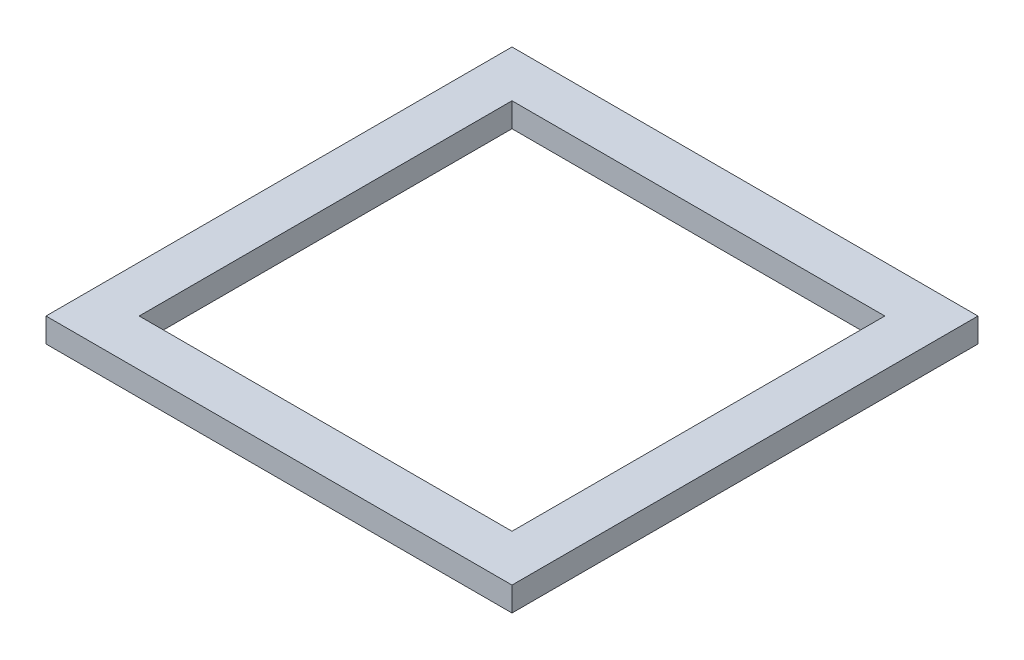
ISO-10303-21;
HEADER;
FILE_DESCRIPTION(('STEP AP214'),'2;1');
FILE_NAME('part.step','',(''),(''),'','','');
FILE_SCHEMA(('AUTOMOTIVE_DESIGN { 1 0 10303 214 1 1 1 1 }'));
ENDSEC;
DATA;
#1=APPLICATION_CONTEXT('core data for automotive mechanical design processes');
#2=APPLICATION_PROTOCOL_DEFINITION('international standard','automotive_design',2000,#1);
#3=PRODUCT_CONTEXT('',#1,'mechanical');
#4=PRODUCT('Part','Part','',(#3));
#5=PRODUCT_RELATED_PRODUCT_CATEGORY('part','',(#4));
#6=PRODUCT_DEFINITION_FORMATION('','',#4);
#7=PRODUCT_DEFINITION_CONTEXT('part definition',#1,'design');
#8=PRODUCT_DEFINITION('design','',#6,#7);
#9=PRODUCT_DEFINITION_SHAPE('','',#8);
#10=(LENGTH_UNIT() NAMED_UNIT(*) SI_UNIT(.MILLI.,.METRE.));
#11=(NAMED_UNIT(*) PLANE_ANGLE_UNIT() SI_UNIT($,.RADIAN.));
#12=(NAMED_UNIT(*) SI_UNIT($,.STERADIAN.) SOLID_ANGLE_UNIT());
#13=UNCERTAINTY_MEASURE_WITH_UNIT(LENGTH_MEASURE(1.E-05),#10,'distance_accuracy_value','');
#14=(GEOMETRIC_REPRESENTATION_CONTEXT(3) GLOBAL_UNCERTAINTY_ASSIGNED_CONTEXT((#13)) GLOBAL_UNIT_ASSIGNED_CONTEXT((#10,
#11,#12)) REPRESENTATION_CONTEXT('',''));
#15=CARTESIAN_POINT('',(0.,0.,0.));
#16=DIRECTION('',(0.,0.,1.));
#17=DIRECTION('',(1.,0.,0.));
#18=AXIS2_PLACEMENT_3D('',#15,#16,#17);
#19=CARTESIAN_POINT('',(0.,6.477,31.75));
#20=DIRECTION('',(0.,0.,-1.));
#21=DIRECTION('',(-1.,0.,0.));
#22=AXIS2_PLACEMENT_3D('',#19,#20,#21);
#23=PLANE('',#22);
#24=DIRECTION('',(1.,0.,0.));
#25=VECTOR('',#24,1.);
#26=CARTESIAN_POINT('',(0.,3.175,31.75));
#27=LINE('',#26,#25);
#28=CARTESIAN_POINT('',(-31.75,3.175,31.75));
#29=VERTEX_POINT('',#28);
#30=CARTESIAN_POINT('',(31.75,3.175,31.75));
#31=VERTEX_POINT('',#30);
#32=EDGE_CURVE('E134',#29,#31,#27,.T.);
#33=ORIENTED_EDGE('',*,*,#32,.T.);
#34=DIRECTION('',(0.,-1.,0.));
#35=VECTOR('',#34,1.);
#36=CARTESIAN_POINT('',(31.75,6.477,31.75));
#37=LINE('',#36,#35);
#38=CARTESIAN_POINT('',(31.75,6.477,31.75));
#39=VERTEX_POINT('',#38);
#40=EDGE_CURVE('E12',#39,#31,#37,.T.);
#41=ORIENTED_EDGE('',*,*,#40,.F.);
#42=DIRECTION('',(1.,0.,0.));
#43=VECTOR('',#42,1.);
#44=CARTESIAN_POINT('',(0.,6.477,31.75));
#45=LINE('',#44,#43);
#46=CARTESIAN_POINT('',(-31.75,6.477,31.75));
#47=VERTEX_POINT('',#46);
#48=EDGE_CURVE('E139',#47,#39,#45,.T.);
#49=ORIENTED_EDGE('',*,*,#48,.F.);
#50=DIRECTION('',(0.,-1.,0.));
#51=VECTOR('',#50,1.);
#52=CARTESIAN_POINT('',(-31.75,6.477,31.75));
#53=LINE('',#52,#51);
#54=EDGE_CURVE('E152',#47,#29,#53,.T.);
#55=ORIENTED_EDGE('',*,*,#54,.T.);
#56=EDGE_LOOP('',(#33,#41,#49,#55));
#57=FACE_BOUND('',#56,.T.);
#58=ADVANCED_FACE('F64',(#57),#23,.F.);
#59=CARTESIAN_POINT('',(31.75,6.477,0.));
#60=DIRECTION('',(1.,0.,0.));
#61=DIRECTION('',(0.,0.,-1.));
#62=AXIS2_PLACEMENT_3D('',#59,#60,#61);
#63=PLANE('',#62);
#64=DIRECTION('',(0.,0.,1.));
#65=VECTOR('',#64,1.);
#66=CARTESIAN_POINT('',(31.75,3.175,0.));
#67=LINE('',#66,#65);
#68=CARTESIAN_POINT('',(31.75,3.175,-31.75));
#69=VERTEX_POINT('',#68);
#70=EDGE_CURVE('E147',#69,#31,#67,.T.);
#71=ORIENTED_EDGE('',*,*,#70,.F.);
#72=DIRECTION('',(0.,-1.,0.));
#73=VECTOR('',#72,1.);
#74=CARTESIAN_POINT('',(31.75,6.477,-31.75));
#75=LINE('',#74,#73);
#76=CARTESIAN_POINT('',(31.75,6.477,-31.75));
#77=VERTEX_POINT('',#76);
#78=EDGE_CURVE('E71',#77,#69,#75,.T.);
#79=ORIENTED_EDGE('',*,*,#78,.F.);
#80=DIRECTION('',(0.,0.,1.));
#81=VECTOR('',#80,1.);
#82=CARTESIAN_POINT('',(31.75,6.477,0.));
#83=LINE('',#82,#81);
#84=EDGE_CURVE('E162',#77,#39,#83,.T.);
#85=ORIENTED_EDGE('',*,*,#84,.T.);
#86=ORIENTED_EDGE('',*,*,#40,.T.);
#87=EDGE_LOOP('',(#71,#79,#85,#86));
#88=FACE_BOUND('',#87,.T.);
#89=ADVANCED_FACE('F217',(#88),#63,.T.);
#90=CARTESIAN_POINT('',(0.,6.477,-31.75));
#91=DIRECTION('',(0.,0.,-1.));
#92=DIRECTION('',(-1.,0.,0.));
#93=AXIS2_PLACEMENT_3D('',#90,#91,#92);
#94=PLANE('',#93);
#95=DIRECTION('',(1.,0.,0.));
#96=VECTOR('',#95,1.);
#97=CARTESIAN_POINT('',(0.,3.175,-31.75));
#98=LINE('',#97,#96);
#99=CARTESIAN_POINT('',(-31.75,3.175,-31.75));
#100=VERTEX_POINT('',#99);
#101=EDGE_CURVE('E131',#100,#69,#98,.T.);
#102=ORIENTED_EDGE('',*,*,#101,.F.);
#103=DIRECTION('',(0.,-1.,0.));
#104=VECTOR('',#103,1.);
#105=CARTESIAN_POINT('',(-31.75,6.477,-31.75));
#106=LINE('',#105,#104);
#107=CARTESIAN_POINT('',(-31.75,6.477,-31.75));
#108=VERTEX_POINT('',#107);
#109=EDGE_CURVE('E144',#108,#100,#106,.T.);
#110=ORIENTED_EDGE('',*,*,#109,.F.);
#111=DIRECTION('',(1.,0.,0.));
#112=VECTOR('',#111,1.);
#113=CARTESIAN_POINT('',(0.,6.477,-31.75));
#114=LINE('',#113,#112);
#115=EDGE_CURVE('E160',#108,#77,#114,.T.);
#116=ORIENTED_EDGE('',*,*,#115,.T.);
#117=ORIENTED_EDGE('',*,*,#78,.T.);
#118=EDGE_LOOP('',(#102,#110,#116,#117));
#119=FACE_BOUND('',#118,.T.);
#120=ADVANCED_FACE('F142',(#119),#94,.T.);
#121=CARTESIAN_POINT('',(-31.75,6.477,0.));
#122=DIRECTION('',(1.,0.,0.));
#123=DIRECTION('',(0.,0.,-1.));
#124=AXIS2_PLACEMENT_3D('',#121,#122,#123);
#125=PLANE('',#124);
#126=DIRECTION('',(0.,0.,1.));
#127=VECTOR('',#126,1.);
#128=CARTESIAN_POINT('',(-31.75,3.175,0.));
#129=LINE('',#128,#127);
#130=EDGE_CURVE('E128',#100,#29,#129,.T.);
#131=ORIENTED_EDGE('',*,*,#130,.T.);
#132=ORIENTED_EDGE('',*,*,#54,.F.);
#133=DIRECTION('',(0.,0.,1.));
#134=VECTOR('',#133,1.);
#135=CARTESIAN_POINT('',(-31.75,6.477,0.));
#136=LINE('',#135,#134);
#137=EDGE_CURVE('E150',#108,#47,#136,.T.);
#138=ORIENTED_EDGE('',*,*,#137,.F.);
#139=ORIENTED_EDGE('',*,*,#109,.T.);
#140=EDGE_LOOP('',(#131,#132,#138,#139));
#141=FACE_BOUND('',#140,.T.);
#142=ADVANCED_FACE('F149',(#141),#125,.F.);
#143=CARTESIAN_POINT('',(0.,6.477,0.));
#144=DIRECTION('',(0.,-1.,0.));
#145=DIRECTION('',(0.,0.,-1.));
#146=AXIS2_PLACEMENT_3D('',#143,#144,#145);
#147=PLANE('',#146);
#148=DIRECTION('',(0.,0.,1.));
#149=VECTOR('',#148,1.);
#150=CARTESIAN_POINT('',(25.4,6.477,0.));
#151=LINE('',#150,#149);
#152=CARTESIAN_POINT('',(25.4,6.477,-25.4));
#153=VERTEX_POINT('',#152);
#154=CARTESIAN_POINT('',(25.4,6.477,25.4));
#155=VERTEX_POINT('',#154);
#156=EDGE_CURVE('E169',#153,#155,#151,.T.);
#157=ORIENTED_EDGE('',*,*,#156,.T.);
#158=DIRECTION('',(-1.,0.,0.));
#159=VECTOR('',#158,1.);
#160=CARTESIAN_POINT('',(0.,6.477,25.4));
#161=LINE('',#160,#159);
#162=CARTESIAN_POINT('',(-25.4,6.477,25.4));
#163=VERTEX_POINT('',#162);
#164=EDGE_CURVE('E176',#155,#163,#161,.T.);
#165=ORIENTED_EDGE('',*,*,#164,.T.);
#166=DIRECTION('',(0.,0.,1.));
#167=VECTOR('',#166,1.);
#168=CARTESIAN_POINT('',(-25.4,6.477,0.));
#169=LINE('',#168,#167);
#170=CARTESIAN_POINT('',(-25.4,6.477,-25.4));
#171=VERTEX_POINT('',#170);
#172=EDGE_CURVE('E188',#171,#163,#169,.T.);
#173=ORIENTED_EDGE('',*,*,#172,.F.);
#174=DIRECTION('',(-1.,0.,0.));
#175=VECTOR('',#174,1.);
#176=CARTESIAN_POINT('',(0.,6.477,-25.4));
#177=LINE('',#176,#175);
#178=EDGE_CURVE('E186',#153,#171,#177,.T.);
#179=ORIENTED_EDGE('',*,*,#178,.F.);
#180=EDGE_LOOP('',(#157,#165,#173,#179));
#181=FACE_BOUND('',#180,.T.);
#182=ORIENTED_EDGE('',*,*,#48,.T.);
#183=ORIENTED_EDGE('',*,*,#84,.F.);
#184=ORIENTED_EDGE('',*,*,#115,.F.);
#185=ORIENTED_EDGE('',*,*,#137,.T.);
#186=EDGE_LOOP('',(#182,#183,#184,#185));
#187=FACE_BOUND('',#186,.T.);
#188=ADVANCED_FACE('F194',(#181,#187),#147,.F.);
#189=CARTESIAN_POINT('',(0.,6.477,25.4));
#190=DIRECTION('',(0.,0.,1.));
#191=DIRECTION('',(1.,0.,0.));
#192=AXIS2_PLACEMENT_3D('',#189,#190,#191);
#193=PLANE('',#192);
#194=DIRECTION('',(-1.,0.,0.));
#195=VECTOR('',#194,1.);
#196=CARTESIAN_POINT('',(0.,3.175,25.4));
#197=LINE('',#196,#195);
#198=CARTESIAN_POINT('',(25.4,3.175,25.4));
#199=VERTEX_POINT('',#198);
#200=CARTESIAN_POINT('',(-25.4,3.175,25.4));
#201=VERTEX_POINT('',#200);
#202=EDGE_CURVE('E181',#199,#201,#197,.T.);
#203=ORIENTED_EDGE('',*,*,#202,.T.);
#204=DIRECTION('',(0.,-1.,0.));
#205=VECTOR('',#204,1.);
#206=CARTESIAN_POINT('',(-25.4,6.477,25.4));
#207=LINE('',#206,#205);
#208=EDGE_CURVE('E166',#163,#201,#207,.T.);
#209=ORIENTED_EDGE('',*,*,#208,.F.);
#210=ORIENTED_EDGE('',*,*,#164,.F.);
#211=DIRECTION('',(0.,-1.,0.));
#212=VECTOR('',#211,1.);
#213=CARTESIAN_POINT('',(25.4,6.477,25.4));
#214=LINE('',#213,#212);
#215=EDGE_CURVE('E158',#155,#199,#214,.T.);
#216=ORIENTED_EDGE('',*,*,#215,.T.);
#217=EDGE_LOOP('',(#203,#209,#210,#216));
#218=FACE_BOUND('',#217,.T.);
#219=ADVANCED_FACE('F200',(#218),#193,.F.);
#220=CARTESIAN_POINT('',(25.4,6.477,0.));
#221=DIRECTION('',(1.,0.,0.));
#222=DIRECTION('',(0.,0.,-1.));
#223=AXIS2_PLACEMENT_3D('',#220,#221,#222);
#224=PLANE('',#223);
#225=DIRECTION('',(0.,0.,1.));
#226=VECTOR('',#225,1.);
#227=CARTESIAN_POINT('',(25.4,3.175,0.));
#228=LINE('',#227,#226);
#229=CARTESIAN_POINT('',(25.4,3.175,-25.4));
#230=VERTEX_POINT('',#229);
#231=EDGE_CURVE('E78',#230,#199,#228,.T.);
#232=ORIENTED_EDGE('',*,*,#231,.T.);
#233=ORIENTED_EDGE('',*,*,#215,.F.);
#234=ORIENTED_EDGE('',*,*,#156,.F.);
#235=DIRECTION('',(0.,-1.,0.));
#236=VECTOR('',#235,1.);
#237=CARTESIAN_POINT('',(25.4,6.477,-25.4));
#238=LINE('',#237,#236);
#239=EDGE_CURVE('E171',#153,#230,#238,.T.);
#240=ORIENTED_EDGE('',*,*,#239,.T.);
#241=EDGE_LOOP('',(#232,#233,#234,#240));
#242=FACE_BOUND('',#241,.T.);
#243=ADVANCED_FACE('F206',(#242),#224,.F.);
#244=CARTESIAN_POINT('',(0.,6.477,-25.4));
#245=DIRECTION('',(0.,0.,1.));
#246=DIRECTION('',(1.,0.,0.));
#247=AXIS2_PLACEMENT_3D('',#244,#245,#246);
#248=PLANE('',#247);
#249=DIRECTION('',(-1.,0.,0.));
#250=VECTOR('',#249,1.);
#251=CARTESIAN_POINT('',(0.,3.175,-25.4));
#252=LINE('',#251,#250);
#253=CARTESIAN_POINT('',(-25.4,3.175,-25.4));
#254=VERTEX_POINT('',#253);
#255=EDGE_CURVE('E177',#230,#254,#252,.T.);
#256=ORIENTED_EDGE('',*,*,#255,.F.);
#257=ORIENTED_EDGE('',*,*,#239,.F.);
#258=ORIENTED_EDGE('',*,*,#178,.T.);
#259=DIRECTION('',(0.,-1.,0.));
#260=VECTOR('',#259,1.);
#261=CARTESIAN_POINT('',(-25.4,6.477,-25.4));
#262=LINE('',#261,#260);
#263=EDGE_CURVE('E86',#171,#254,#262,.T.);
#264=ORIENTED_EDGE('',*,*,#263,.T.);
#265=EDGE_LOOP('',(#256,#257,#258,#264));
#266=FACE_BOUND('',#265,.T.);
#267=ADVANCED_FACE('F204',(#266),#248,.T.);
#268=CARTESIAN_POINT('',(-25.4,6.477,0.));
#269=DIRECTION('',(1.,0.,0.));
#270=DIRECTION('',(0.,0.,-1.));
#271=AXIS2_PLACEMENT_3D('',#268,#269,#270);
#272=PLANE('',#271);
#273=DIRECTION('',(0.,0.,1.));
#274=VECTOR('',#273,1.);
#275=CARTESIAN_POINT('',(-25.4,3.175,0.));
#276=LINE('',#275,#274);
#277=EDGE_CURVE('E179',#254,#201,#276,.T.);
#278=ORIENTED_EDGE('',*,*,#277,.F.);
#279=ORIENTED_EDGE('',*,*,#263,.F.);
#280=ORIENTED_EDGE('',*,*,#172,.T.);
#281=ORIENTED_EDGE('',*,*,#208,.T.);
#282=EDGE_LOOP('',(#278,#279,#280,#281));
#283=FACE_BOUND('',#282,.T.);
#284=ADVANCED_FACE('F201',(#283),#272,.T.);
#285=CARTESIAN_POINT('',(0.,3.175,0.));
#286=DIRECTION('',(0.,1.,0.));
#287=DIRECTION('',(0.,0.,1.));
#288=AXIS2_PLACEMENT_3D('',#285,#286,#287);
#289=PLANE('',#288);
#290=ORIENTED_EDGE('',*,*,#277,.T.);
#291=ORIENTED_EDGE('',*,*,#202,.F.);
#292=ORIENTED_EDGE('',*,*,#231,.F.);
#293=ORIENTED_EDGE('',*,*,#255,.T.);
#294=EDGE_LOOP('',(#290,#291,#292,#293));
#295=FACE_BOUND('',#294,.T.);
#296=ORIENTED_EDGE('',*,*,#130,.F.);
#297=ORIENTED_EDGE('',*,*,#101,.T.);
#298=ORIENTED_EDGE('',*,*,#70,.T.);
#299=ORIENTED_EDGE('',*,*,#32,.F.);
#300=EDGE_LOOP('',(#296,#297,#298,#299));
#301=FACE_BOUND('',#300,.T.);
#302=ADVANCED_FACE('F130',(#295,#301),#289,.F.);
#303=CLOSED_SHELL('',(#58,#89,#120,#142,#188,#219,#243,#267,#284,#302));
#304=MANIFOLD_SOLID_BREP('B2',#303);
#305=ADVANCED_BREP_SHAPE_REPRESENTATION('',(#18,#304),#14);
#306=SHAPE_DEFINITION_REPRESENTATION(#9,#305);
ENDSEC;
END-ISO-10303-21;
